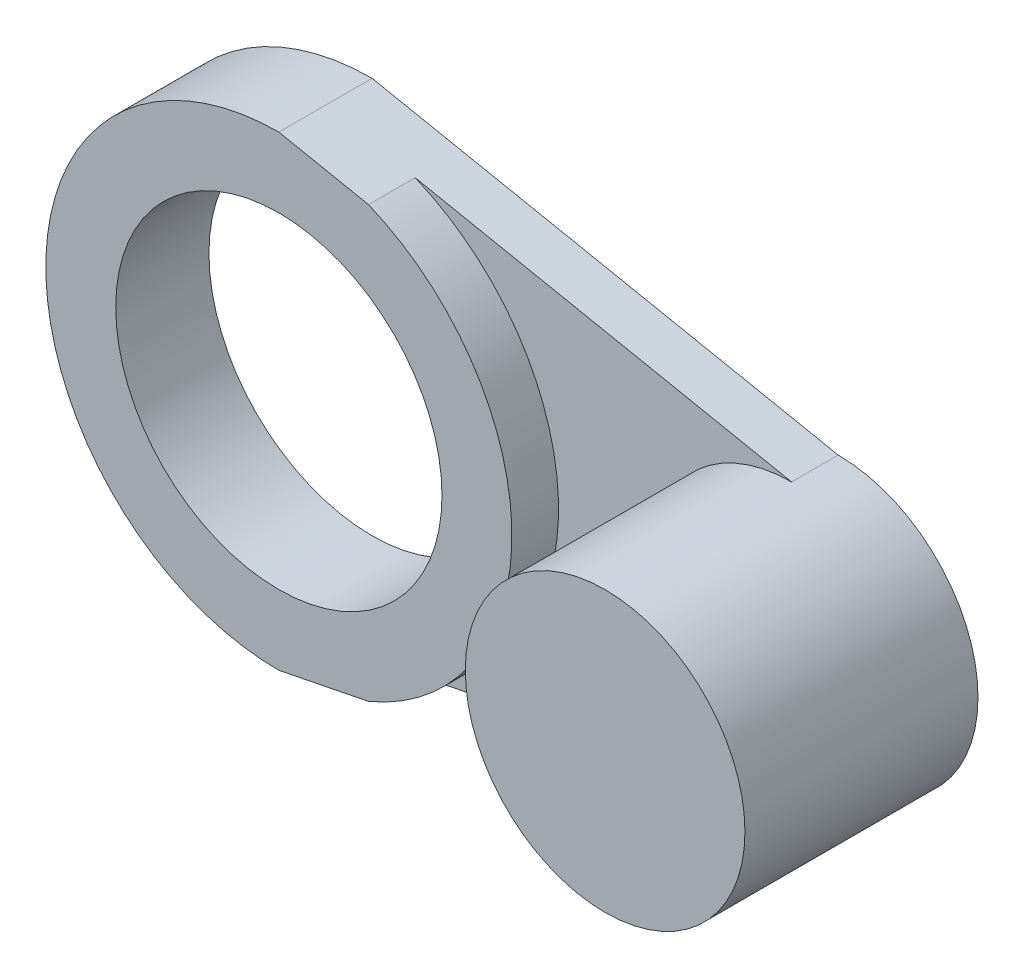
ISO-10303-21;
HEADER;
FILE_DESCRIPTION(('STEP AP214'),'2;1');
FILE_NAME('part.step','',(''),(''),'','','');
FILE_SCHEMA(('AUTOMOTIVE_DESIGN { 1 0 10303 214 1 1 1 1 }'));
ENDSEC;
DATA;
#1=APPLICATION_CONTEXT('core data for automotive mechanical design processes');
#2=APPLICATION_PROTOCOL_DEFINITION('international standard','automotive_design',2000,#1);
#3=PRODUCT_CONTEXT('',#1,'mechanical');
#4=PRODUCT('Part','Part','',(#3));
#5=PRODUCT_RELATED_PRODUCT_CATEGORY('part','',(#4));
#6=PRODUCT_DEFINITION_FORMATION('','',#4);
#7=PRODUCT_DEFINITION_CONTEXT('part definition',#1,'design');
#8=PRODUCT_DEFINITION('design','',#6,#7);
#9=PRODUCT_DEFINITION_SHAPE('','',#8);
#10=(LENGTH_UNIT() NAMED_UNIT(*) SI_UNIT(.MILLI.,.METRE.));
#11=(NAMED_UNIT(*) PLANE_ANGLE_UNIT() SI_UNIT($,.RADIAN.));
#12=(NAMED_UNIT(*) SI_UNIT($,.STERADIAN.) SOLID_ANGLE_UNIT());
#13=UNCERTAINTY_MEASURE_WITH_UNIT(LENGTH_MEASURE(1.E-05),#10,'distance_accuracy_value','');
#14=(GEOMETRIC_REPRESENTATION_CONTEXT(3) GLOBAL_UNCERTAINTY_ASSIGNED_CONTEXT((#13)) GLOBAL_UNIT_ASSIGNED_CONTEXT((#10,
#11,#12)) REPRESENTATION_CONTEXT('',''));
#15=CARTESIAN_POINT('',(0.,0.,0.));
#16=DIRECTION('',(0.,0.,1.));
#17=DIRECTION('',(1.,0.,0.));
#18=AXIS2_PLACEMENT_3D('',#15,#16,#17);
#19=CARTESIAN_POINT('',(4.80769230769231,-24.0384615384615,-5.));
#20=DIRECTION('',(0.196116135138184,-0.98058067569092,0.));
#21=DIRECTION('',(0.98058067569092,0.196116135138184,0.));
#22=AXIS2_PLACEMENT_3D('',#19,#20,#21);
#23=PLANE('',#22);
#24=DIRECTION('',(0.98058067569092,0.196116135138184,0.));
#25=VECTOR('',#24,1.);
#26=CARTESIAN_POINT('',(4.80769230769231,-24.0384615384615,0.));
#27=LINE('',#26,#25);
#28=CARTESIAN_POINT('',(9.61538461538463,-23.0769230769231,0.));
#29=VERTEX_POINT('',#28);
#30=CARTESIAN_POINT('',(50.,-15.,0.));
#31=VERTEX_POINT('',#30);
#32=EDGE_CURVE('E72',#29,#31,#27,.T.);
#33=ORIENTED_EDGE('',*,*,#32,.F.);
#34=DIRECTION('',(0.,0.,1.));
#35=VECTOR('',#34,1.);
#36=CARTESIAN_POINT('',(9.61538461538463,-23.0769230769231,-5.));
#37=LINE('',#36,#35);
#38=CARTESIAN_POINT('',(9.61538461538463,-23.0769230769231,5.));
#39=VERTEX_POINT('',#38);
#40=EDGE_CURVE('E129',#29,#39,#37,.T.);
#41=ORIENTED_EDGE('',*,*,#40,.T.);
#42=DIRECTION('',(0.98058067569092,0.196116135138184,0.));
#43=VECTOR('',#42,1.);
#44=CARTESIAN_POINT('',(4.80769230769231,-24.0384615384615,5.));
#45=LINE('',#44,#43);
#46=CARTESIAN_POINT('',(0.,-25.,5.));
#47=VERTEX_POINT('',#46);
#48=EDGE_CURVE('E110',#47,#39,#45,.T.);
#49=ORIENTED_EDGE('',*,*,#48,.F.);
#50=DIRECTION('',(0.,0.,1.));
#51=VECTOR('',#50,1.);
#52=CARTESIAN_POINT('',(0.,-25.,-5.));
#53=LINE('',#52,#51);
#54=CARTESIAN_POINT('',(0.,-25.,-5.));
#55=VERTEX_POINT('',#54);
#56=EDGE_CURVE('E101',#55,#47,#53,.T.);
#57=ORIENTED_EDGE('',*,*,#56,.F.);
#58=DIRECTION('',(0.98058067569092,0.196116135138184,0.));
#59=VECTOR('',#58,1.);
#60=CARTESIAN_POINT('',(4.80769230769231,-24.0384615384615,-5.));
#61=LINE('',#60,#59);
#62=CARTESIAN_POINT('',(50.,-15.,-5.));
#63=VERTEX_POINT('',#62);
#64=EDGE_CURVE('E53',#55,#63,#61,.T.);
#65=ORIENTED_EDGE('',*,*,#64,.T.);
#66=DIRECTION('',(0.,0.,1.));
#67=VECTOR('',#66,1.);
#68=CARTESIAN_POINT('',(50.,-15.,-5.));
#69=LINE('',#68,#67);
#70=EDGE_CURVE('E11',#63,#31,#69,.T.);
#71=ORIENTED_EDGE('',*,*,#70,.T.);
#72=EDGE_LOOP('',(#33,#41,#49,#57,#65,#71));
#73=FACE_BOUND('',#72,.T.);
#74=ADVANCED_FACE('F37',(#73),#23,.T.);
#75=CARTESIAN_POINT('',(4.80769230769231,24.0384615384615,-5.));
#76=DIRECTION('',(-0.196116135138184,-0.98058067569092,0.));
#77=DIRECTION('',(0.98058067569092,-0.196116135138184,0.));
#78=AXIS2_PLACEMENT_3D('',#75,#76,#77);
#79=PLANE('',#78);
#80=DIRECTION('',(0.98058067569092,-0.196116135138184,0.));
#81=VECTOR('',#80,1.);
#82=CARTESIAN_POINT('',(4.80769230769231,24.0384615384615,0.));
#83=LINE('',#82,#81);
#84=CARTESIAN_POINT('',(9.61538461538463,23.0769230769231,0.));
#85=VERTEX_POINT('',#84);
#86=CARTESIAN_POINT('',(50.,15.,0.));
#87=VERTEX_POINT('',#86);
#88=EDGE_CURVE('E65',#85,#87,#83,.T.);
#89=ORIENTED_EDGE('',*,*,#88,.T.);
#90=DIRECTION('',(0.,0.,1.));
#91=VECTOR('',#90,1.);
#92=CARTESIAN_POINT('',(50.,15.,-5.));
#93=LINE('',#92,#91);
#94=CARTESIAN_POINT('',(50.,15.,-5.));
#95=VERTEX_POINT('',#94);
#96=EDGE_CURVE('E41',#95,#87,#93,.T.);
#97=ORIENTED_EDGE('',*,*,#96,.F.);
#98=DIRECTION('',(0.98058067569092,-0.196116135138184,0.));
#99=VECTOR('',#98,1.);
#100=CARTESIAN_POINT('',(4.80769230769231,24.0384615384615,-5.));
#101=LINE('',#100,#99);
#102=CARTESIAN_POINT('',(0.,25.,-5.));
#103=VERTEX_POINT('',#102);
#104=EDGE_CURVE('E97',#103,#95,#101,.T.);
#105=ORIENTED_EDGE('',*,*,#104,.F.);
#106=DIRECTION('',(0.,0.,1.));
#107=VECTOR('',#106,1.);
#108=CARTESIAN_POINT('',(0.,25.,-5.));
#109=LINE('',#108,#107);
#110=CARTESIAN_POINT('',(0.,25.,5.));
#111=VERTEX_POINT('',#110);
#112=EDGE_CURVE('E93',#103,#111,#109,.T.);
#113=ORIENTED_EDGE('',*,*,#112,.T.);
#114=DIRECTION('',(0.98058067569092,-0.196116135138184,0.));
#115=VECTOR('',#114,1.);
#116=CARTESIAN_POINT('',(4.80769230769231,24.0384615384615,5.));
#117=LINE('',#116,#115);
#118=CARTESIAN_POINT('',(9.61538461538463,23.0769230769231,5.));
#119=VERTEX_POINT('',#118);
#120=EDGE_CURVE('E96',#111,#119,#117,.T.);
#121=ORIENTED_EDGE('',*,*,#120,.T.);
#122=DIRECTION('',(0.,0.,1.));
#123=VECTOR('',#122,1.);
#124=CARTESIAN_POINT('',(9.61538461538463,23.0769230769231,-5.));
#125=LINE('',#124,#123);
#126=EDGE_CURVE('E126',#85,#119,#125,.T.);
#127=ORIENTED_EDGE('',*,*,#126,.F.);
#128=EDGE_LOOP('',(#89,#97,#105,#113,#121,#127));
#129=FACE_BOUND('',#128,.T.);
#130=ADVANCED_FACE('F39',(#129),#79,.F.);
#131=CARTESIAN_POINT('',(0.,0.,-5.));
#132=DIRECTION('',(0.,0.,1.));
#133=DIRECTION('',(1.,0.,0.));
#134=AXIS2_PLACEMENT_3D('',#131,#132,#133);
#135=PLANE('',#134);
#136=ORIENTED_EDGE('',*,*,#104,.T.);
#137=CARTESIAN_POINT('',(50.,0.,-5.));
#138=DIRECTION('',(0.,0.,1.));
#139=DIRECTION('',(1.,0.,0.));
#140=AXIS2_PLACEMENT_3D('',#137,#138,#139);
#141=CIRCLE('',#140,15.);
#142=EDGE_CURVE('E134',#63,#95,#141,.T.);
#143=ORIENTED_EDGE('',*,*,#142,.F.);
#144=ORIENTED_EDGE('',*,*,#64,.F.);
#145=CARTESIAN_POINT('',(0.,0.,-5.));
#146=DIRECTION('',(0.,0.,1.));
#147=DIRECTION('',(1.,0.,0.));
#148=AXIS2_PLACEMENT_3D('',#145,#146,#147);
#149=CIRCLE('',#148,25.);
#150=EDGE_CURVE('E102',#103,#55,#149,.T.);
#151=ORIENTED_EDGE('',*,*,#150,.F.);
#152=EDGE_LOOP('',(#136,#143,#144,#151));
#153=FACE_BOUND('',#152,.T.);
#154=CARTESIAN_POINT('',(0.,0.,-5.));
#155=DIRECTION('',(0.,0.,1.));
#156=DIRECTION('',(1.,0.,0.));
#157=AXIS2_PLACEMENT_3D('',#154,#155,#156);
#158=CIRCLE('',#157,17.5);
#159=CARTESIAN_POINT('',(17.5,0.,-5.));
#160=VERTEX_POINT('',#159);
#161=EDGE_CURVE('E122',#160,#160,#158,.T.);
#162=ORIENTED_EDGE('',*,*,#161,.T.);
#163=EDGE_LOOP('',(#162));
#164=FACE_BOUND('',#163,.T.);
#165=ADVANCED_FACE('F156',(#153,#164),#135,.F.);
#166=CARTESIAN_POINT('',(0.,0.,0.));
#167=DIRECTION('',(0.,0.,1.));
#168=DIRECTION('',(1.,0.,0.));
#169=AXIS2_PLACEMENT_3D('',#166,#167,#168);
#170=PLANE('',#169);
#171=CARTESIAN_POINT('',(50.,0.,0.));
#172=DIRECTION('',(0.,0.,1.));
#173=DIRECTION('',(1.,0.,0.));
#174=AXIS2_PLACEMENT_3D('',#171,#172,#173);
#175=CIRCLE('',#174,15.);
#176=EDGE_CURVE('E137',#87,#31,#175,.T.);
#177=ORIENTED_EDGE('',*,*,#176,.F.);
#178=ORIENTED_EDGE('',*,*,#88,.F.);
#179=CARTESIAN_POINT('',(0.,0.,0.));
#180=DIRECTION('',(0.,0.,1.));
#181=DIRECTION('',(1.,0.,0.));
#182=AXIS2_PLACEMENT_3D('',#179,#180,#181);
#183=CIRCLE('',#182,25.);
#184=EDGE_CURVE('E143',#29,#85,#183,.T.);
#185=ORIENTED_EDGE('',*,*,#184,.F.);
#186=ORIENTED_EDGE('',*,*,#32,.T.);
#187=EDGE_LOOP('',(#177,#178,#185,#186));
#188=FACE_BOUND('',#187,.T.);
#189=ADVANCED_FACE('F149',(#188),#170,.T.);
#190=CARTESIAN_POINT('',(50.,0.,-5.));
#191=DIRECTION('',(0.,0.,1.));
#192=DIRECTION('',(1.,0.,0.));
#193=AXIS2_PLACEMENT_3D('',#190,#191,#192);
#194=CYLINDRICAL_SURFACE('',#193,15.);
#195=ORIENTED_EDGE('',*,*,#176,.T.);
#196=ORIENTED_EDGE('',*,*,#70,.F.);
#197=ORIENTED_EDGE('',*,*,#142,.T.);
#198=ORIENTED_EDGE('',*,*,#96,.T.);
#199=EDGE_LOOP('',(#195,#196,#197,#198));
#200=FACE_BOUND('',#199,.T.);
#201=CARTESIAN_POINT('',(50.,0.,20.));
#202=DIRECTION('',(0.,0.,1.));
#203=DIRECTION('',(1.,0.,0.));
#204=AXIS2_PLACEMENT_3D('',#201,#202,#203);
#205=CIRCLE('',#204,15.);
#206=CARTESIAN_POINT('',(65.,0.,20.));
#207=VERTEX_POINT('',#206);
#208=EDGE_CURVE('E128',#207,#207,#205,.T.);
#209=ORIENTED_EDGE('',*,*,#208,.F.);
#210=EDGE_LOOP('',(#209));
#211=FACE_BOUND('',#210,.T.);
#212=ADVANCED_FACE('F153',(#200,#211),#194,.T.);
#213=CARTESIAN_POINT('',(0.,0.,20.));
#214=DIRECTION('',(0.,0.,1.));
#215=DIRECTION('',(1.,0.,0.));
#216=AXIS2_PLACEMENT_3D('',#213,#214,#215);
#217=PLANE('',#216);
#218=ORIENTED_EDGE('',*,*,#208,.T.);
#219=EDGE_LOOP('',(#218));
#220=FACE_BOUND('',#219,.T.);
#221=ADVANCED_FACE('F183',(#220),#217,.T.);
#222=CARTESIAN_POINT('',(0.,0.,-5.));
#223=DIRECTION('',(0.,0.,1.));
#224=DIRECTION('',(1.,0.,0.));
#225=AXIS2_PLACEMENT_3D('',#222,#223,#224);
#226=CYLINDRICAL_SURFACE('',#225,25.);
#227=ORIENTED_EDGE('',*,*,#40,.F.);
#228=ORIENTED_EDGE('',*,*,#184,.T.);
#229=ORIENTED_EDGE('',*,*,#126,.T.);
#230=CARTESIAN_POINT('',(0.,0.,5.));
#231=DIRECTION('',(0.,0.,1.));
#232=DIRECTION('',(1.,0.,0.));
#233=AXIS2_PLACEMENT_3D('',#230,#231,#232);
#234=CIRCLE('',#233,25.);
#235=EDGE_CURVE('E112',#39,#119,#234,.T.);
#236=ORIENTED_EDGE('',*,*,#235,.F.);
#237=EDGE_LOOP('',(#227,#228,#229,#236));
#238=FACE_BOUND('',#237,.T.);
#239=ADVANCED_FACE('F148',(#238),#226,.T.);
#240=CARTESIAN_POINT('',(0.,0.,-5.));
#241=DIRECTION('',(0.,0.,1.));
#242=DIRECTION('',(1.,0.,0.));
#243=AXIS2_PLACEMENT_3D('',#240,#241,#242);
#244=CYLINDRICAL_SURFACE('',#243,17.5);
#245=ORIENTED_EDGE('',*,*,#161,.F.);
#246=EDGE_LOOP('',(#245));
#247=FACE_BOUND('',#246,.T.);
#248=CARTESIAN_POINT('',(0.,0.,5.));
#249=DIRECTION('',(0.,0.,1.));
#250=DIRECTION('',(1.,0.,0.));
#251=AXIS2_PLACEMENT_3D('',#248,#249,#250);
#252=CIRCLE('',#251,17.5);
#253=CARTESIAN_POINT('',(17.5,0.,5.));
#254=VERTEX_POINT('',#253);
#255=EDGE_CURVE('E116',#254,#254,#252,.T.);
#256=ORIENTED_EDGE('',*,*,#255,.T.);
#257=EDGE_LOOP('',(#256));
#258=FACE_BOUND('',#257,.T.);
#259=ADVANCED_FACE('F162',(#247,#258),#244,.F.);
#260=ORIENTED_EDGE('',*,*,#56,.T.);
#261=EDGE_CURVE('E105',#111,#47,#234,.T.);
#262=ORIENTED_EDGE('',*,*,#261,.F.);
#263=ORIENTED_EDGE('',*,*,#112,.F.);
#264=ORIENTED_EDGE('',*,*,#150,.T.);
#265=EDGE_LOOP('',(#260,#262,#263,#264));
#266=FACE_BOUND('',#265,.T.);
#267=ADVANCED_FACE('F106',(#266),#226,.T.);
#268=CARTESIAN_POINT('',(0.,0.,5.));
#269=DIRECTION('',(0.,0.,1.));
#270=DIRECTION('',(1.,0.,0.));
#271=AXIS2_PLACEMENT_3D('',#268,#269,#270);
#272=PLANE('',#271);
#273=ORIENTED_EDGE('',*,*,#255,.F.);
#274=EDGE_LOOP('',(#273));
#275=FACE_BOUND('',#274,.T.);
#276=ORIENTED_EDGE('',*,*,#120,.F.);
#277=ORIENTED_EDGE('',*,*,#261,.T.);
#278=ORIENTED_EDGE('',*,*,#48,.T.);
#279=ORIENTED_EDGE('',*,*,#235,.T.);
#280=EDGE_LOOP('',(#276,#277,#278,#279));
#281=FACE_BOUND('',#280,.T.);
#282=ADVANCED_FACE('F114',(#275,#281),#272,.T.);
#283=CLOSED_SHELL('',(#74,#130,#165,#189,#212,#221,#239,#259,#267,#282));
#284=MANIFOLD_SOLID_BREP('B2',#283);
#285=ADVANCED_BREP_SHAPE_REPRESENTATION('',(#18,#284),#14);
#286=SHAPE_DEFINITION_REPRESENTATION(#9,#285);
ENDSEC;
END-ISO-10303-21;
